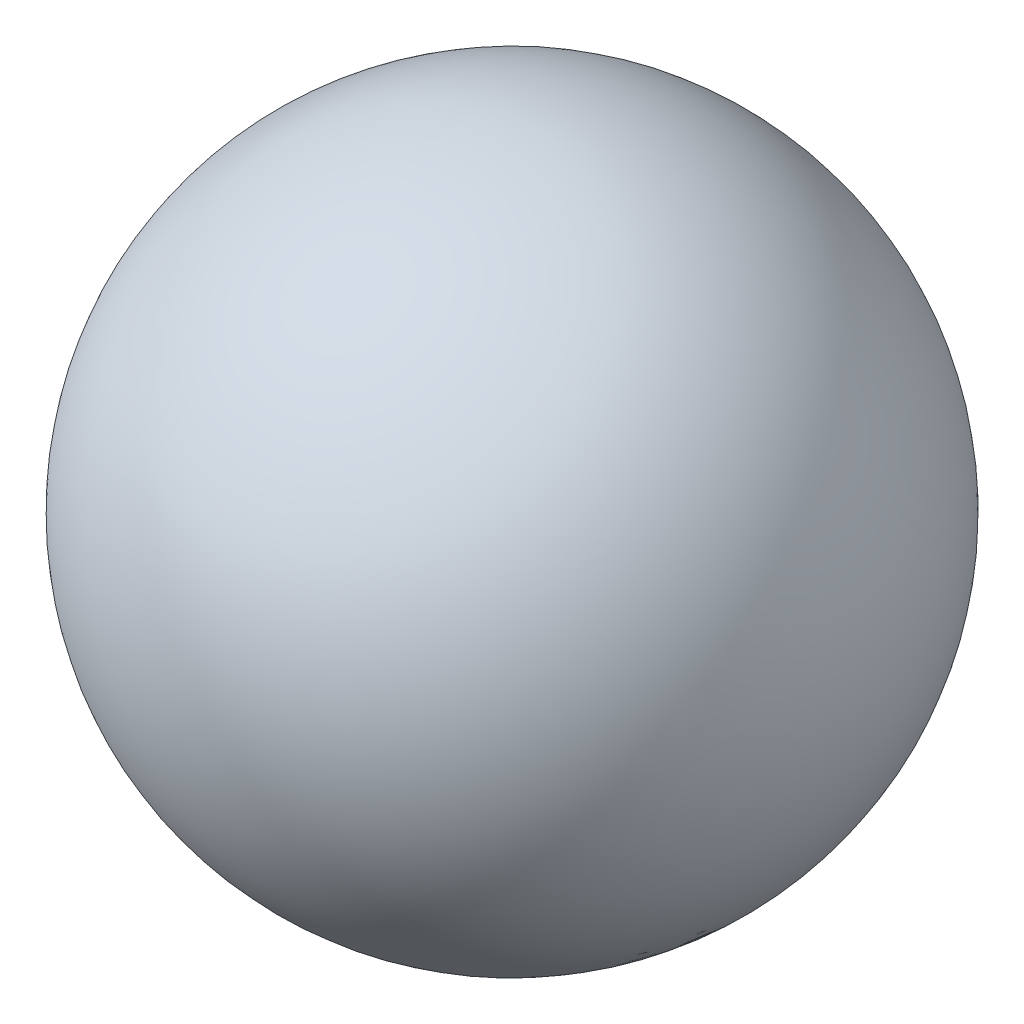
ISO-10303-21;
HEADER;
FILE_DESCRIPTION(('STEP AP214'),'2;1');
FILE_NAME('part.step','',(''),(''),'','','');
FILE_SCHEMA(('AUTOMOTIVE_DESIGN { 1 0 10303 214 1 1 1 1 }'));
ENDSEC;
DATA;
#1=APPLICATION_CONTEXT('core data for automotive mechanical design processes');
#2=APPLICATION_PROTOCOL_DEFINITION('international standard','automotive_design',2000,#1);
#3=PRODUCT_CONTEXT('',#1,'mechanical');
#4=PRODUCT('Part','Part','',(#3));
#5=PRODUCT_RELATED_PRODUCT_CATEGORY('part','',(#4));
#6=PRODUCT_DEFINITION_FORMATION('','',#4);
#7=PRODUCT_DEFINITION_CONTEXT('part definition',#1,'design');
#8=PRODUCT_DEFINITION('design','',#6,#7);
#9=PRODUCT_DEFINITION_SHAPE('','',#8);
#10=(LENGTH_UNIT() NAMED_UNIT(*) SI_UNIT(.MILLI.,.METRE.));
#11=(NAMED_UNIT(*) PLANE_ANGLE_UNIT() SI_UNIT($,.RADIAN.));
#12=(NAMED_UNIT(*) SI_UNIT($,.STERADIAN.) SOLID_ANGLE_UNIT());
#13=UNCERTAINTY_MEASURE_WITH_UNIT(LENGTH_MEASURE(1.E-05),#10,'distance_accuracy_value','');
#14=(GEOMETRIC_REPRESENTATION_CONTEXT(3) GLOBAL_UNCERTAINTY_ASSIGNED_CONTEXT((#13)) GLOBAL_UNIT_ASSIGNED_CONTEXT((#10,
#11,#12)) REPRESENTATION_CONTEXT('',''));
#15=CARTESIAN_POINT('',(0.,0.,0.));
#16=DIRECTION('',(0.,0.,1.));
#17=DIRECTION('',(1.,0.,0.));
#18=AXIS2_PLACEMENT_3D('',#15,#16,#17);
#19=CARTESIAN_POINT('',(0.,0.,0.));
#20=DIRECTION('',(0.828450203225271,0.185068580248535,0.528601817421014));
#21=DIRECTION('',(0.279801175790824,-0.954366316192777,-0.104385039841451));
#22=AXIS2_PLACEMENT_3D('',#19,#20,#21);
#23=SPHERICAL_SURFACE('',#22,1.1905);
#24=CARTESIAN_POINT('',(-0.986269966939685,-0.220324144785882,-0.629300463639717));
#25=VERTEX_POINT('',#24);
#26=VERTEX_LOOP('',#25);
#27=FACE_BOUND('',#26,.T.);
#28=CARTESIAN_POINT('',(0.986269966939685,0.220324144785881,0.629300463639717));
#29=VERTEX_POINT('',#28);
#30=VERTEX_LOOP('',#29);
#31=FACE_BOUND('',#30,.T.);
#32=ADVANCED_FACE('F15',(#27,#31),#23,.T.);
#33=CLOSED_SHELL('',(#32));
#34=MANIFOLD_SOLID_BREP('B1',#33);
#35=ADVANCED_BREP_SHAPE_REPRESENTATION('',(#18,#34),#14);
#36=SHAPE_DEFINITION_REPRESENTATION(#9,#35);
ENDSEC;
END-ISO-10303-21;
